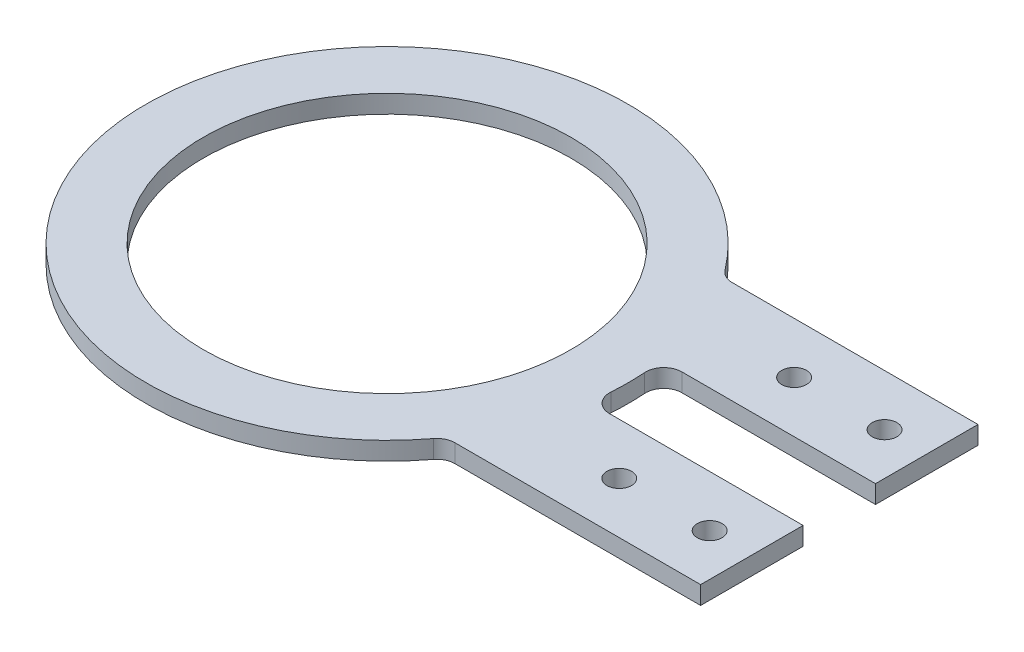
ISO-10303-21;
HEADER;
FILE_DESCRIPTION(('STEP AP214'),'2;1');
FILE_NAME('part.step','',(''),(''),'','','');
FILE_SCHEMA(('AUTOMOTIVE_DESIGN { 1 0 10303 214 1 1 1 1 }'));
ENDSEC;
DATA;
#1=APPLICATION_CONTEXT('core data for automotive mechanical design processes');
#2=APPLICATION_PROTOCOL_DEFINITION('international standard','automotive_design',2000,#1);
#3=PRODUCT_CONTEXT('',#1,'mechanical');
#4=PRODUCT('Part','Part','',(#3));
#5=PRODUCT_RELATED_PRODUCT_CATEGORY('part','',(#4));
#6=PRODUCT_DEFINITION_FORMATION('','',#4);
#7=PRODUCT_DEFINITION_CONTEXT('part definition',#1,'design');
#8=PRODUCT_DEFINITION('design','',#6,#7);
#9=PRODUCT_DEFINITION_SHAPE('','',#8);
#10=(LENGTH_UNIT() NAMED_UNIT(*) SI_UNIT(.MILLI.,.METRE.));
#11=(NAMED_UNIT(*) PLANE_ANGLE_UNIT() SI_UNIT($,.RADIAN.));
#12=(NAMED_UNIT(*) SI_UNIT($,.STERADIAN.) SOLID_ANGLE_UNIT());
#13=UNCERTAINTY_MEASURE_WITH_UNIT(LENGTH_MEASURE(1.E-05),#10,'distance_accuracy_value','');
#14=(GEOMETRIC_REPRESENTATION_CONTEXT(3) GLOBAL_UNCERTAINTY_ASSIGNED_CONTEXT((#13)) GLOBAL_UNIT_ASSIGNED_CONTEXT((#10,
#11,#12)) REPRESENTATION_CONTEXT('',''));
#15=CARTESIAN_POINT('',(0.,0.,0.));
#16=DIRECTION('',(0.,0.,1.));
#17=DIRECTION('',(1.,0.,0.));
#18=AXIS2_PLACEMENT_3D('',#15,#16,#17);
#19=CARTESIAN_POINT('',(0.,3.,0.));
#20=DIRECTION('',(0.,-1.,0.));
#21=DIRECTION('',(0.,0.,-1.));
#22=AXIS2_PLACEMENT_3D('',#19,#20,#21);
#23=CYLINDRICAL_SURFACE('',#22,40.);
#24=CARTESIAN_POINT('',(0.,3.,0.));
#25=DIRECTION('',(0.,1.,0.));
#26=DIRECTION('',(0.,0.,1.));
#27=AXIS2_PLACEMENT_3D('',#24,#25,#26);
#28=CIRCLE('',#27,40.);
#29=CARTESIAN_POINT('',(39.902531329353,3.,2.79069767441861));
#30=VERTEX_POINT('',#29);
#31=CARTESIAN_POINT('',(39.902531329353,3.,-2.79069767441861));
#32=VERTEX_POINT('',#31);
#33=EDGE_CURVE('E186',#30,#32,#28,.T.);
#34=ORIENTED_EDGE('',*,*,#33,.F.);
#35=DIRECTION('',(0.,-1.,0.));
#36=VECTOR('',#35,1.);
#37=CARTESIAN_POINT('',(39.902531329353,3.,2.79069767441861));
#38=LINE('',#37,#36);
#39=CARTESIAN_POINT('',(39.902531329353,0.,2.79069767441861));
#40=VERTEX_POINT('',#39);
#41=EDGE_CURVE('E192',#30,#40,#38,.T.);
#42=ORIENTED_EDGE('',*,*,#41,.T.);
#43=CARTESIAN_POINT('',(0.,0.,0.));
#44=DIRECTION('',(0.,1.,0.));
#45=DIRECTION('',(0.,0.,1.));
#46=AXIS2_PLACEMENT_3D('',#43,#44,#45);
#47=CIRCLE('',#46,40.);
#48=CARTESIAN_POINT('',(39.902531329353,0.,-2.79069767441861));
#49=VERTEX_POINT('',#48);
#50=EDGE_CURVE('E180',#40,#49,#47,.T.);
#51=ORIENTED_EDGE('',*,*,#50,.T.);
#52=DIRECTION('',(0.,-1.,0.));
#53=VECTOR('',#52,1.);
#54=CARTESIAN_POINT('',(39.902531329353,3.,-2.79069767441861));
#55=LINE('',#54,#53);
#56=EDGE_CURVE('E185',#49,#32,#55,.F.);
#57=ORIENTED_EDGE('',*,*,#56,.T.);
#58=EDGE_LOOP('',(#34,#42,#51,#57));
#59=FACE_BOUND('',#58,.T.);
#60=ADVANCED_FACE('F33',(#59),#23,.T.);
#61=CARTESIAN_POINT('',(0.,3.,0.));
#62=DIRECTION('',(0.,1.,0.));
#63=DIRECTION('',(0.,0.,1.));
#64=AXIS2_PLACEMENT_3D('',#61,#62,#63);
#65=PLANE('',#64);
#66=CARTESIAN_POINT('',(53.,3.,14.5));
#67=DIRECTION('',(0.,1.,0.));
#68=DIRECTION('',(0.,0.,1.));
#69=AXIS2_PLACEMENT_3D('',#66,#67,#68);
#70=CIRCLE('',#69,2.05);
#71=CARTESIAN_POINT('',(53.,3.,16.55));
#72=VERTEX_POINT('',#71);
#73=EDGE_CURVE('E263',#72,#72,#70,.T.);
#74=ORIENTED_EDGE('',*,*,#73,.F.);
#75=EDGE_LOOP('',(#74));
#76=FACE_BOUND('',#75,.T.);
#77=CARTESIAN_POINT('',(68.,3.,-14.5));
#78=DIRECTION('',(0.,1.,0.));
#79=DIRECTION('',(0.,0.,1.));
#80=AXIS2_PLACEMENT_3D('',#77,#78,#79);
#81=CIRCLE('',#80,2.04999999999999);
#82=CARTESIAN_POINT('',(68.,3.,-12.45));
#83=VERTEX_POINT('',#82);
#84=EDGE_CURVE('E269',#83,#83,#81,.T.);
#85=ORIENTED_EDGE('',*,*,#84,.F.);
#86=EDGE_LOOP('',(#85));
#87=FACE_BOUND('',#86,.T.);
#88=CARTESIAN_POINT('',(68.,3.,14.5));
#89=DIRECTION('',(0.,1.,0.));
#90=DIRECTION('',(0.,0.,1.));
#91=AXIS2_PLACEMENT_3D('',#88,#89,#90);
#92=CIRCLE('',#91,2.04999999999999);
#93=CARTESIAN_POINT('',(68.,3.,16.55));
#94=VERTEX_POINT('',#93);
#95=EDGE_CURVE('E275',#94,#94,#92,.T.);
#96=ORIENTED_EDGE('',*,*,#95,.F.);
#97=EDGE_LOOP('',(#96));
#98=FACE_BOUND('',#97,.T.);
#99=CARTESIAN_POINT('',(53.,3.,-14.5));
#100=DIRECTION('',(0.,1.,0.));
#101=DIRECTION('',(0.,0.,1.));
#102=AXIS2_PLACEMENT_3D('',#99,#100,#101);
#103=CIRCLE('',#102,2.05);
#104=CARTESIAN_POINT('',(53.,3.,-12.45));
#105=VERTEX_POINT('',#104);
#106=EDGE_CURVE('E257',#105,#105,#103,.T.);
#107=ORIENTED_EDGE('',*,*,#106,.F.);
#108=EDGE_LOOP('',(#107));
#109=FACE_BOUND('',#108,.T.);
#110=DIRECTION('',(-1.,0.,0.));
#111=VECTOR('',#110,1.);
#112=CARTESIAN_POINT('',(32.7261363439071,3.,-23.));
#113=LINE('',#112,#111);
#114=CARTESIAN_POINT('',(75.,3.,-23.));
#115=VERTEX_POINT('',#114);
#116=CARTESIAN_POINT('',(34.2490875790874,3.,-23.));
#117=VERTEX_POINT('',#116);
#118=EDGE_CURVE('E168',#115,#117,#113,.T.);
#119=ORIENTED_EDGE('',*,*,#118,.T.);
#120=CARTESIAN_POINT('',(34.2490875790874,3.,-26.));
#121=DIRECTION('',(0.,1.,0.));
#122=DIRECTION('',(0.,0.,1.));
#123=AXIS2_PLACEMENT_3D('',#120,#121,#122);
#124=CIRCLE('',#123,3.);
#125=CARTESIAN_POINT('',(31.8596163526395,3.,-24.1860465116279));
#126=VERTEX_POINT('',#125);
#127=EDGE_CURVE('E41',#117,#126,#124,.F.);
#128=ORIENTED_EDGE('',*,*,#127,.T.);
#129=CARTESIAN_POINT('',(31.8596163526395,3.,24.1860465116279));
#130=VERTEX_POINT('',#129);
#131=EDGE_CURVE('E183',#126,#130,#28,.T.);
#132=ORIENTED_EDGE('',*,*,#131,.T.);
#133=CARTESIAN_POINT('',(34.2490875790874,3.,26.));
#134=DIRECTION('',(0.,1.,0.));
#135=DIRECTION('',(0.,0.,1.));
#136=AXIS2_PLACEMENT_3D('',#133,#134,#135);
#137=CIRCLE('',#136,3.);
#138=CARTESIAN_POINT('',(34.2490875790874,3.,23.));
#139=VERTEX_POINT('',#138);
#140=EDGE_CURVE('E131',#130,#139,#137,.F.);
#141=ORIENTED_EDGE('',*,*,#140,.T.);
#142=DIRECTION('',(1.,0.,0.));
#143=VECTOR('',#142,1.);
#144=CARTESIAN_POINT('',(32.7261363439072,3.,23.));
#145=LINE('',#144,#143);
#146=CARTESIAN_POINT('',(75.,3.,23.));
#147=VERTEX_POINT('',#146);
#148=EDGE_CURVE('E121',#139,#147,#145,.T.);
#149=ORIENTED_EDGE('',*,*,#148,.T.);
#150=DIRECTION('',(0.,0.,-1.));
#151=VECTOR('',#150,1.);
#152=CARTESIAN_POINT('',(75.,3.,6.));
#153=LINE('',#152,#151);
#154=CARTESIAN_POINT('',(75.,3.,6.));
#155=VERTEX_POINT('',#154);
#156=EDGE_CURVE('E128',#147,#155,#153,.T.);
#157=ORIENTED_EDGE('',*,*,#156,.T.);
#158=DIRECTION('',(-1.,0.,0.));
#159=VECTOR('',#158,1.);
#160=CARTESIAN_POINT('',(32.7261363439072,3.,6.));
#161=LINE('',#160,#159);
#162=CARTESIAN_POINT('',(42.8952211790544,3.,6.));
#163=VERTEX_POINT('',#162);
#164=EDGE_CURVE('E145',#155,#163,#161,.T.);
#165=ORIENTED_EDGE('',*,*,#164,.T.);
#166=CARTESIAN_POINT('',(42.8952211790544,3.,3.));
#167=DIRECTION('',(0.,1.,0.));
#168=DIRECTION('',(0.,0.,1.));
#169=AXIS2_PLACEMENT_3D('',#166,#167,#168);
#170=CIRCLE('',#169,3.);
#171=EDGE_CURVE('E210',#163,#30,#170,.F.);
#172=ORIENTED_EDGE('',*,*,#171,.T.);
#173=ORIENTED_EDGE('',*,*,#33,.T.);
#174=CARTESIAN_POINT('',(42.8952211790544,3.,-3.));
#175=DIRECTION('',(0.,1.,0.));
#176=DIRECTION('',(0.,0.,1.));
#177=AXIS2_PLACEMENT_3D('',#174,#175,#176);
#178=CIRCLE('',#177,3.);
#179=CARTESIAN_POINT('',(42.8952211790544,3.,-6.));
#180=VERTEX_POINT('',#179);
#181=EDGE_CURVE('E215',#32,#180,#178,.F.);
#182=ORIENTED_EDGE('',*,*,#181,.T.);
#183=DIRECTION('',(1.,0.,0.));
#184=VECTOR('',#183,1.);
#185=CARTESIAN_POINT('',(32.7261363439071,3.,-6.));
#186=LINE('',#185,#184);
#187=CARTESIAN_POINT('',(75.,3.,-6.));
#188=VERTEX_POINT('',#187);
#189=EDGE_CURVE('E156',#180,#188,#186,.T.);
#190=ORIENTED_EDGE('',*,*,#189,.T.);
#191=DIRECTION('',(0.,0.,-1.));
#192=VECTOR('',#191,1.);
#193=CARTESIAN_POINT('',(75.,3.,-23.));
#194=LINE('',#193,#192);
#195=EDGE_CURVE('E165',#188,#115,#194,.T.);
#196=ORIENTED_EDGE('',*,*,#195,.T.);
#197=EDGE_LOOP('',(#119,#128,#132,#141,#149,#157,#165,#172,#173,#182,#190,#196));
#198=FACE_BOUND('',#197,.T.);
#199=CARTESIAN_POINT('',(0.,3.,0.));
#200=DIRECTION('',(0.,1.,0.));
#201=DIRECTION('',(0.,0.,1.));
#202=AXIS2_PLACEMENT_3D('',#199,#200,#201);
#203=CIRCLE('',#202,30.5);
#204=CARTESIAN_POINT('',(0.,3.,30.5));
#205=VERTEX_POINT('',#204);
#206=EDGE_CURVE('E177',#205,#205,#203,.T.);
#207=ORIENTED_EDGE('',*,*,#206,.F.);
#208=EDGE_LOOP('',(#207));
#209=FACE_BOUND('',#208,.T.);
#210=ADVANCED_FACE('F124',(#76,#87,#98,#109,#198,#209),#65,.T.);
#211=CARTESIAN_POINT('',(0.,0.,0.));
#212=DIRECTION('',(0.,1.,0.));
#213=DIRECTION('',(0.,0.,1.));
#214=AXIS2_PLACEMENT_3D('',#211,#212,#213);
#215=PLANE('',#214);
#216=CARTESIAN_POINT('',(53.,0.,14.5));
#217=DIRECTION('',(0.,1.,0.));
#218=DIRECTION('',(0.,0.,1.));
#219=AXIS2_PLACEMENT_3D('',#216,#217,#218);
#220=CIRCLE('',#219,2.05);
#221=CARTESIAN_POINT('',(53.,0.,16.55));
#222=VERTEX_POINT('',#221);
#223=EDGE_CURVE('E266',#222,#222,#220,.T.);
#224=ORIENTED_EDGE('',*,*,#223,.T.);
#225=EDGE_LOOP('',(#224));
#226=FACE_BOUND('',#225,.T.);
#227=CARTESIAN_POINT('',(68.,0.,-14.5));
#228=DIRECTION('',(0.,1.,0.));
#229=DIRECTION('',(0.,0.,1.));
#230=AXIS2_PLACEMENT_3D('',#227,#228,#229);
#231=CIRCLE('',#230,2.04999999999999);
#232=CARTESIAN_POINT('',(68.,0.,-12.45));
#233=VERTEX_POINT('',#232);
#234=EDGE_CURVE('E272',#233,#233,#231,.T.);
#235=ORIENTED_EDGE('',*,*,#234,.T.);
#236=EDGE_LOOP('',(#235));
#237=FACE_BOUND('',#236,.T.);
#238=CARTESIAN_POINT('',(68.,0.,14.5));
#239=DIRECTION('',(0.,1.,0.));
#240=DIRECTION('',(0.,0.,1.));
#241=AXIS2_PLACEMENT_3D('',#238,#239,#240);
#242=CIRCLE('',#241,2.04999999999999);
#243=CARTESIAN_POINT('',(68.,0.,16.55));
#244=VERTEX_POINT('',#243);
#245=EDGE_CURVE('E260',#244,#244,#242,.T.);
#246=ORIENTED_EDGE('',*,*,#245,.T.);
#247=EDGE_LOOP('',(#246));
#248=FACE_BOUND('',#247,.T.);
#249=CARTESIAN_POINT('',(53.,0.,-14.5));
#250=DIRECTION('',(0.,1.,0.));
#251=DIRECTION('',(0.,0.,1.));
#252=AXIS2_PLACEMENT_3D('',#249,#250,#251);
#253=CIRCLE('',#252,2.05);
#254=CARTESIAN_POINT('',(53.,0.,-12.45));
#255=VERTEX_POINT('',#254);
#256=EDGE_CURVE('E134',#255,#255,#253,.T.);
#257=ORIENTED_EDGE('',*,*,#256,.T.);
#258=EDGE_LOOP('',(#257));
#259=FACE_BOUND('',#258,.T.);
#260=DIRECTION('',(-1.,0.,0.));
#261=VECTOR('',#260,1.);
#262=CARTESIAN_POINT('',(32.7261363439072,0.,23.));
#263=LINE('',#262,#261);
#264=CARTESIAN_POINT('',(75.,0.,23.));
#265=VERTEX_POINT('',#264);
#266=CARTESIAN_POINT('',(34.2490875790874,0.,23.));
#267=VERTEX_POINT('',#266);
#268=EDGE_CURVE('E141',#265,#267,#263,.T.);
#269=ORIENTED_EDGE('',*,*,#268,.T.);
#270=CARTESIAN_POINT('',(34.2490875790874,0.,26.));
#271=DIRECTION('',(0.,1.,0.));
#272=DIRECTION('',(0.,0.,1.));
#273=AXIS2_PLACEMENT_3D('',#270,#271,#272);
#274=CIRCLE('',#273,3.);
#275=CARTESIAN_POINT('',(31.8596163526395,0.,24.1860465116279));
#276=VERTEX_POINT('',#275);
#277=EDGE_CURVE('E213',#267,#276,#274,.T.);
#278=ORIENTED_EDGE('',*,*,#277,.T.);
#279=CARTESIAN_POINT('',(31.8596163526395,0.,-24.1860465116279));
#280=VERTEX_POINT('',#279);
#281=EDGE_CURVE('E187',#280,#276,#47,.T.);
#282=ORIENTED_EDGE('',*,*,#281,.F.);
#283=CARTESIAN_POINT('',(34.2490875790874,0.,-26.));
#284=DIRECTION('',(0.,1.,0.));
#285=DIRECTION('',(0.,0.,1.));
#286=AXIS2_PLACEMENT_3D('',#283,#284,#285);
#287=CIRCLE('',#286,3.);
#288=CARTESIAN_POINT('',(34.2490875790874,0.,-23.));
#289=VERTEX_POINT('',#288);
#290=EDGE_CURVE('E11',#280,#289,#287,.T.);
#291=ORIENTED_EDGE('',*,*,#290,.T.);
#292=DIRECTION('',(1.,0.,0.));
#293=VECTOR('',#292,1.);
#294=CARTESIAN_POINT('',(32.7261363439071,0.,-23.));
#295=LINE('',#294,#293);
#296=CARTESIAN_POINT('',(75.,0.,-23.));
#297=VERTEX_POINT('',#296);
#298=EDGE_CURVE('E160',#289,#297,#295,.T.);
#299=ORIENTED_EDGE('',*,*,#298,.T.);
#300=DIRECTION('',(0.,0.,1.));
#301=VECTOR('',#300,1.);
#302=CARTESIAN_POINT('',(75.,0.,-23.));
#303=LINE('',#302,#301);
#304=CARTESIAN_POINT('',(75.,0.,-6.));
#305=VERTEX_POINT('',#304);
#306=EDGE_CURVE('E158',#297,#305,#303,.T.);
#307=ORIENTED_EDGE('',*,*,#306,.T.);
#308=DIRECTION('',(-1.,0.,0.));
#309=VECTOR('',#308,1.);
#310=CARTESIAN_POINT('',(32.7261363439071,0.,-6.));
#311=LINE('',#310,#309);
#312=CARTESIAN_POINT('',(42.8952211790544,0.,-6.));
#313=VERTEX_POINT('',#312);
#314=EDGE_CURVE('E163',#305,#313,#311,.T.);
#315=ORIENTED_EDGE('',*,*,#314,.T.);
#316=CARTESIAN_POINT('',(42.8952211790544,0.,-3.));
#317=DIRECTION('',(0.,1.,0.));
#318=DIRECTION('',(0.,0.,1.));
#319=AXIS2_PLACEMENT_3D('',#316,#317,#318);
#320=CIRCLE('',#319,3.);
#321=EDGE_CURVE('E217',#313,#49,#320,.T.);
#322=ORIENTED_EDGE('',*,*,#321,.T.);
#323=ORIENTED_EDGE('',*,*,#50,.F.);
#324=CARTESIAN_POINT('',(42.8952211790544,0.,3.));
#325=DIRECTION('',(0.,1.,0.));
#326=DIRECTION('',(0.,0.,1.));
#327=AXIS2_PLACEMENT_3D('',#324,#325,#326);
#328=CIRCLE('',#327,3.);
#329=CARTESIAN_POINT('',(42.8952211790544,0.,6.));
#330=VERTEX_POINT('',#329);
#331=EDGE_CURVE('E208',#40,#330,#328,.T.);
#332=ORIENTED_EDGE('',*,*,#331,.T.);
#333=DIRECTION('',(1.,0.,0.));
#334=VECTOR('',#333,1.);
#335=CARTESIAN_POINT('',(32.7261363439072,0.,6.));
#336=LINE('',#335,#334);
#337=CARTESIAN_POINT('',(75.,0.,6.));
#338=VERTEX_POINT('',#337);
#339=EDGE_CURVE('E157',#330,#338,#336,.T.);
#340=ORIENTED_EDGE('',*,*,#339,.T.);
#341=DIRECTION('',(0.,0.,1.));
#342=VECTOR('',#341,1.);
#343=CARTESIAN_POINT('',(75.,0.,6.));
#344=LINE('',#343,#342);
#345=EDGE_CURVE('E153',#338,#265,#344,.T.);
#346=ORIENTED_EDGE('',*,*,#345,.T.);
#347=EDGE_LOOP('',(#269,#278,#282,#291,#299,#307,#315,#322,#323,#332,#340,#346));
#348=FACE_BOUND('',#347,.T.);
#349=CARTESIAN_POINT('',(0.,0.,0.));
#350=DIRECTION('',(0.,1.,0.));
#351=DIRECTION('',(0.,0.,1.));
#352=AXIS2_PLACEMENT_3D('',#349,#350,#351);
#353=CIRCLE('',#352,30.5);
#354=CARTESIAN_POINT('',(0.,0.,30.5));
#355=VERTEX_POINT('',#354);
#356=EDGE_CURVE('E176',#355,#355,#353,.T.);
#357=ORIENTED_EDGE('',*,*,#356,.T.);
#358=EDGE_LOOP('',(#357));
#359=FACE_BOUND('',#358,.T.);
#360=ADVANCED_FACE('F227',(#226,#237,#248,#259,#348,#359),#215,.F.);
#361=ORIENTED_EDGE('',*,*,#281,.T.);
#362=DIRECTION('',(0.,-1.,0.));
#363=VECTOR('',#362,1.);
#364=CARTESIAN_POINT('',(31.8596163526395,3.,24.1860465116279));
#365=LINE('',#364,#363);
#366=EDGE_CURVE('E199',#276,#130,#365,.F.);
#367=ORIENTED_EDGE('',*,*,#366,.T.);
#368=ORIENTED_EDGE('',*,*,#131,.F.);
#369=DIRECTION('',(0.,-1.,0.));
#370=VECTOR('',#369,1.);
#371=CARTESIAN_POINT('',(31.8596163526395,3.,-24.1860465116279));
#372=LINE('',#371,#370);
#373=EDGE_CURVE('E197',#126,#280,#372,.T.);
#374=ORIENTED_EDGE('',*,*,#373,.T.);
#375=EDGE_LOOP('',(#361,#367,#368,#374));
#376=FACE_BOUND('',#375,.T.);
#377=ADVANCED_FACE('F221',(#376),#23,.T.);
#378=CARTESIAN_POINT('',(0.,3.,0.));
#379=DIRECTION('',(0.,-1.,0.));
#380=DIRECTION('',(0.,0.,-1.));
#381=AXIS2_PLACEMENT_3D('',#378,#379,#380);
#382=CYLINDRICAL_SURFACE('',#381,30.5);
#383=ORIENTED_EDGE('',*,*,#206,.T.);
#384=EDGE_LOOP('',(#383));
#385=FACE_BOUND('',#384,.T.);
#386=ORIENTED_EDGE('',*,*,#356,.F.);
#387=EDGE_LOOP('',(#386));
#388=FACE_BOUND('',#387,.T.);
#389=ADVANCED_FACE('F314',(#385,#388),#382,.F.);
#390=CARTESIAN_POINT('',(32.7261363439071,-45.5640159381713,-6.));
#391=DIRECTION('',(0.,0.,1.));
#392=DIRECTION('',(1.,0.,0.));
#393=AXIS2_PLACEMENT_3D('',#390,#391,#392);
#394=PLANE('',#393);
#395=ORIENTED_EDGE('',*,*,#189,.F.);
#396=DIRECTION('',(0.,-1.,0.));
#397=VECTOR('',#396,1.);
#398=CARTESIAN_POINT('',(42.8952211790544,-45.5640159381713,-6.));
#399=LINE('',#398,#397);
#400=EDGE_CURVE('E204',#180,#313,#399,.T.);
#401=ORIENTED_EDGE('',*,*,#400,.T.);
#402=ORIENTED_EDGE('',*,*,#314,.F.);
#403=DIRECTION('',(0.,1.,0.));
#404=VECTOR('',#403,1.);
#405=CARTESIAN_POINT('',(75.,-45.5640159381713,-6.));
#406=LINE('',#405,#404);
#407=EDGE_CURVE('E170',#305,#188,#406,.T.);
#408=ORIENTED_EDGE('',*,*,#407,.T.);
#409=EDGE_LOOP('',(#395,#401,#402,#408));
#410=FACE_BOUND('',#409,.T.);
#411=ADVANCED_FACE('F236',(#410),#394,.T.);
#412=CARTESIAN_POINT('',(32.7261363439071,-45.5640159381713,-23.));
#413=DIRECTION('',(0.,0.,-1.));
#414=DIRECTION('',(-1.,0.,0.));
#415=AXIS2_PLACEMENT_3D('',#412,#413,#414);
#416=PLANE('',#415);
#417=ORIENTED_EDGE('',*,*,#298,.F.);
#418=DIRECTION('',(0.,-1.,0.));
#419=VECTOR('',#418,1.);
#420=CARTESIAN_POINT('',(34.2490875790874,-45.5640159381713,-23.));
#421=LINE('',#420,#419);
#422=EDGE_CURVE('E206',#289,#117,#421,.F.);
#423=ORIENTED_EDGE('',*,*,#422,.T.);
#424=ORIENTED_EDGE('',*,*,#118,.F.);
#425=DIRECTION('',(0.,1.,0.));
#426=VECTOR('',#425,1.);
#427=CARTESIAN_POINT('',(75.,-45.5640159381713,-23.));
#428=LINE('',#427,#426);
#429=EDGE_CURVE('E161',#297,#115,#428,.T.);
#430=ORIENTED_EDGE('',*,*,#429,.F.);
#431=EDGE_LOOP('',(#417,#423,#424,#430));
#432=FACE_BOUND('',#431,.T.);
#433=ADVANCED_FACE('F224',(#432),#416,.T.);
#434=CARTESIAN_POINT('',(75.,-45.5640159381713,-23.));
#435=DIRECTION('',(1.,0.,0.));
#436=DIRECTION('',(0.,0.,-1.));
#437=AXIS2_PLACEMENT_3D('',#434,#435,#436);
#438=PLANE('',#437);
#439=ORIENTED_EDGE('',*,*,#306,.F.);
#440=ORIENTED_EDGE('',*,*,#429,.T.);
#441=ORIENTED_EDGE('',*,*,#195,.F.);
#442=ORIENTED_EDGE('',*,*,#407,.F.);
#443=EDGE_LOOP('',(#439,#440,#441,#442));
#444=FACE_BOUND('',#443,.T.);
#445=ADVANCED_FACE('F231',(#444),#438,.T.);
#446=CARTESIAN_POINT('',(32.7261363439072,-45.5640159381713,6.));
#447=DIRECTION('',(0.,0.,-1.));
#448=DIRECTION('',(-1.,0.,0.));
#449=AXIS2_PLACEMENT_3D('',#446,#447,#448);
#450=PLANE('',#449);
#451=ORIENTED_EDGE('',*,*,#339,.F.);
#452=DIRECTION('',(0.,-1.,0.));
#453=VECTOR('',#452,1.);
#454=CARTESIAN_POINT('',(42.8952211790544,-45.5640159381713,6.));
#455=LINE('',#454,#453);
#456=EDGE_CURVE('E195',#330,#163,#455,.F.);
#457=ORIENTED_EDGE('',*,*,#456,.T.);
#458=ORIENTED_EDGE('',*,*,#164,.F.);
#459=DIRECTION('',(0.,1.,0.));
#460=VECTOR('',#459,1.);
#461=CARTESIAN_POINT('',(75.,-45.5640159381713,6.));
#462=LINE('',#461,#460);
#463=EDGE_CURVE('E144',#338,#155,#462,.T.);
#464=ORIENTED_EDGE('',*,*,#463,.F.);
#465=EDGE_LOOP('',(#451,#457,#458,#464));
#466=FACE_BOUND('',#465,.T.);
#467=ADVANCED_FACE('F254',(#466),#450,.T.);
#468=CARTESIAN_POINT('',(75.,-45.5640159381713,6.));
#469=DIRECTION('',(1.,0.,0.));
#470=DIRECTION('',(0.,0.,-1.));
#471=AXIS2_PLACEMENT_3D('',#468,#469,#470);
#472=PLANE('',#471);
#473=ORIENTED_EDGE('',*,*,#345,.F.);
#474=ORIENTED_EDGE('',*,*,#463,.T.);
#475=ORIENTED_EDGE('',*,*,#156,.F.);
#476=DIRECTION('',(0.,1.,0.));
#477=VECTOR('',#476,1.);
#478=CARTESIAN_POINT('',(75.,-45.5640159381713,23.));
#479=LINE('',#478,#477);
#480=EDGE_CURVE('E138',#265,#147,#479,.T.);
#481=ORIENTED_EDGE('',*,*,#480,.F.);
#482=EDGE_LOOP('',(#473,#474,#475,#481));
#483=FACE_BOUND('',#482,.T.);
#484=ADVANCED_FACE('F147',(#483),#472,.T.);
#485=CARTESIAN_POINT('',(32.7261363439072,-45.5640159381713,23.));
#486=DIRECTION('',(0.,0.,1.));
#487=DIRECTION('',(1.,0.,0.));
#488=AXIS2_PLACEMENT_3D('',#485,#486,#487);
#489=PLANE('',#488);
#490=ORIENTED_EDGE('',*,*,#148,.F.);
#491=DIRECTION('',(0.,-1.,0.));
#492=VECTOR('',#491,1.);
#493=CARTESIAN_POINT('',(34.2490875790874,-45.5640159381713,23.));
#494=LINE('',#493,#492);
#495=EDGE_CURVE('E202',#139,#267,#494,.T.);
#496=ORIENTED_EDGE('',*,*,#495,.T.);
#497=ORIENTED_EDGE('',*,*,#268,.F.);
#498=ORIENTED_EDGE('',*,*,#480,.T.);
#499=EDGE_LOOP('',(#490,#496,#497,#498));
#500=FACE_BOUND('',#499,.T.);
#501=ADVANCED_FACE('F139',(#500),#489,.T.);
#502=CARTESIAN_POINT('',(53.,0.,-14.5));
#503=DIRECTION('',(0.,1.,0.));
#504=DIRECTION('',(0.,0.,1.));
#505=AXIS2_PLACEMENT_3D('',#502,#503,#504);
#506=CYLINDRICAL_SURFACE('',#505,2.05);
#507=ORIENTED_EDGE('',*,*,#256,.F.);
#508=EDGE_LOOP('',(#507));
#509=FACE_BOUND('',#508,.T.);
#510=ORIENTED_EDGE('',*,*,#106,.T.);
#511=EDGE_LOOP('',(#510));
#512=FACE_BOUND('',#511,.T.);
#513=ADVANCED_FACE('F287',(#509,#512),#506,.F.);
#514=CARTESIAN_POINT('',(68.,0.,14.5));
#515=DIRECTION('',(0.,1.,0.));
#516=DIRECTION('',(0.,0.,1.));
#517=AXIS2_PLACEMENT_3D('',#514,#515,#516);
#518=CYLINDRICAL_SURFACE('',#517,2.04999999999999);
#519=ORIENTED_EDGE('',*,*,#245,.F.);
#520=EDGE_LOOP('',(#519));
#521=FACE_BOUND('',#520,.T.);
#522=ORIENTED_EDGE('',*,*,#95,.T.);
#523=EDGE_LOOP('',(#522));
#524=FACE_BOUND('',#523,.T.);
#525=ADVANCED_FACE('F283',(#521,#524),#518,.F.);
#526=CARTESIAN_POINT('',(68.,0.,-14.5));
#527=DIRECTION('',(0.,1.,0.));
#528=DIRECTION('',(0.,0.,1.));
#529=AXIS2_PLACEMENT_3D('',#526,#527,#528);
#530=CYLINDRICAL_SURFACE('',#529,2.04999999999999);
#531=ORIENTED_EDGE('',*,*,#234,.F.);
#532=EDGE_LOOP('',(#531));
#533=FACE_BOUND('',#532,.T.);
#534=ORIENTED_EDGE('',*,*,#84,.T.);
#535=EDGE_LOOP('',(#534));
#536=FACE_BOUND('',#535,.T.);
#537=ADVANCED_FACE('F286',(#533,#536),#530,.F.);
#538=CARTESIAN_POINT('',(53.,0.,14.5));
#539=DIRECTION('',(0.,1.,0.));
#540=DIRECTION('',(0.,0.,1.));
#541=AXIS2_PLACEMENT_3D('',#538,#539,#540);
#542=CYLINDRICAL_SURFACE('',#541,2.05);
#543=ORIENTED_EDGE('',*,*,#223,.F.);
#544=EDGE_LOOP('',(#543));
#545=FACE_BOUND('',#544,.T.);
#546=ORIENTED_EDGE('',*,*,#73,.T.);
#547=EDGE_LOOP('',(#546));
#548=FACE_BOUND('',#547,.T.);
#549=ADVANCED_FACE('F358',(#545,#548),#542,.F.);
#550=CARTESIAN_POINT('',(42.8952211790544,3.,3.));
#551=DIRECTION('',(0.,-1.,0.));
#552=DIRECTION('',(0.,0.,-1.));
#553=AXIS2_PLACEMENT_3D('',#550,#551,#552);
#554=CYLINDRICAL_SURFACE('',#553,3.);
#555=ORIENTED_EDGE('',*,*,#171,.F.);
#556=ORIENTED_EDGE('',*,*,#456,.F.);
#557=ORIENTED_EDGE('',*,*,#331,.F.);
#558=ORIENTED_EDGE('',*,*,#41,.F.);
#559=EDGE_LOOP('',(#555,#556,#557,#558));
#560=FACE_BOUND('',#559,.T.);
#561=ADVANCED_FACE('F251',(#560),#554,.F.);
#562=CARTESIAN_POINT('',(34.2490875790874,3.,26.));
#563=DIRECTION('',(0.,-1.,0.));
#564=DIRECTION('',(0.,0.,-1.));
#565=AXIS2_PLACEMENT_3D('',#562,#563,#564);
#566=CYLINDRICAL_SURFACE('',#565,3.);
#567=ORIENTED_EDGE('',*,*,#277,.F.);
#568=ORIENTED_EDGE('',*,*,#495,.F.);
#569=ORIENTED_EDGE('',*,*,#140,.F.);
#570=ORIENTED_EDGE('',*,*,#366,.F.);
#571=EDGE_LOOP('',(#567,#568,#569,#570));
#572=FACE_BOUND('',#571,.T.);
#573=ADVANCED_FACE('F357',(#572),#566,.F.);
#574=CARTESIAN_POINT('',(42.8952211790544,3.,-3.));
#575=DIRECTION('',(0.,-1.,0.));
#576=DIRECTION('',(0.,0.,-1.));
#577=AXIS2_PLACEMENT_3D('',#574,#575,#576);
#578=CYLINDRICAL_SURFACE('',#577,3.);
#579=ORIENTED_EDGE('',*,*,#321,.F.);
#580=ORIENTED_EDGE('',*,*,#400,.F.);
#581=ORIENTED_EDGE('',*,*,#181,.F.);
#582=ORIENTED_EDGE('',*,*,#56,.F.);
#583=EDGE_LOOP('',(#579,#580,#581,#582));
#584=FACE_BOUND('',#583,.T.);
#585=ADVANCED_FACE('F243',(#584),#578,.F.);
#586=CARTESIAN_POINT('',(34.2490875790874,3.,-26.));
#587=DIRECTION('',(0.,-1.,0.));
#588=DIRECTION('',(0.,0.,-1.));
#589=AXIS2_PLACEMENT_3D('',#586,#587,#588);
#590=CYLINDRICAL_SURFACE('',#589,3.);
#591=ORIENTED_EDGE('',*,*,#290,.F.);
#592=ORIENTED_EDGE('',*,*,#373,.F.);
#593=ORIENTED_EDGE('',*,*,#127,.F.);
#594=ORIENTED_EDGE('',*,*,#422,.F.);
#595=EDGE_LOOP('',(#591,#592,#593,#594));
#596=FACE_BOUND('',#595,.T.);
#597=ADVANCED_FACE('F35',(#596),#590,.F.);
#598=CLOSED_SHELL('',(#60,#210,#360,#377,#389,#411,#433,#445,#467,#484,#501,#513,#525,#537,#549,
#561,#573,#585,#597));
#599=MANIFOLD_SOLID_BREP('B2',#598);
#600=ADVANCED_BREP_SHAPE_REPRESENTATION('',(#18,#599),#14);
#601=SHAPE_DEFINITION_REPRESENTATION(#9,#600);
ENDSEC;
END-ISO-10303-21;
